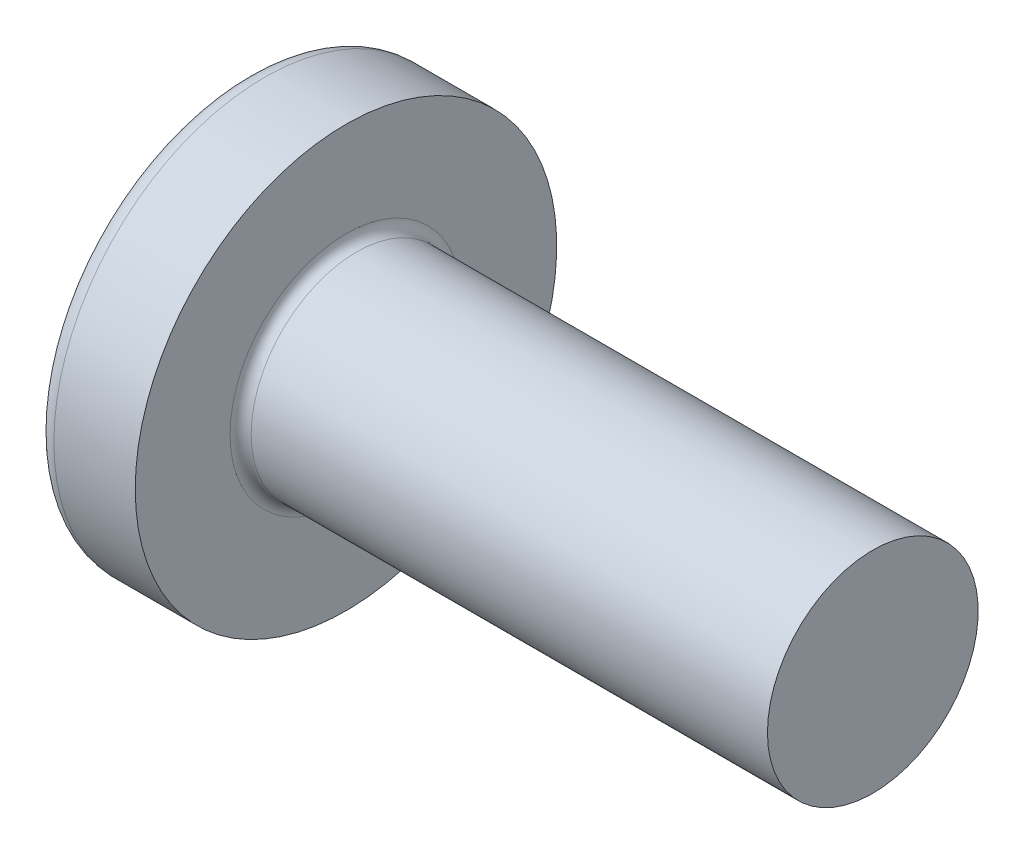
ISO-10303-21;
HEADER;
FILE_DESCRIPTION(('STEP AP214'),'2;1');
FILE_NAME('part.step','',(''),(''),'','','');
FILE_SCHEMA(('AUTOMOTIVE_DESIGN { 1 0 10303 214 1 1 1 1 }'));
ENDSEC;
DATA;
#1=APPLICATION_CONTEXT('core data for automotive mechanical design processes');
#2=APPLICATION_PROTOCOL_DEFINITION('international standard','automotive_design',2000,#1);
#3=PRODUCT_CONTEXT('',#1,'mechanical');
#4=PRODUCT('Part','Part','',(#3));
#5=PRODUCT_RELATED_PRODUCT_CATEGORY('part','',(#4));
#6=PRODUCT_DEFINITION_FORMATION('','',#4);
#7=PRODUCT_DEFINITION_CONTEXT('part definition',#1,'design');
#8=PRODUCT_DEFINITION('design','',#6,#7);
#9=PRODUCT_DEFINITION_SHAPE('','',#8);
#10=(LENGTH_UNIT() NAMED_UNIT(*) SI_UNIT(.MILLI.,.METRE.));
#11=(NAMED_UNIT(*) PLANE_ANGLE_UNIT() SI_UNIT($,.RADIAN.));
#12=(NAMED_UNIT(*) SI_UNIT($,.STERADIAN.) SOLID_ANGLE_UNIT());
#13=UNCERTAINTY_MEASURE_WITH_UNIT(LENGTH_MEASURE(1.E-05),#10,'distance_accuracy_value','');
#14=(GEOMETRIC_REPRESENTATION_CONTEXT(3) GLOBAL_UNCERTAINTY_ASSIGNED_CONTEXT((#13)) GLOBAL_UNIT_ASSIGNED_CONTEXT((#10,
#11,#12)) REPRESENTATION_CONTEXT('',''));
#15=CARTESIAN_POINT('',(0.,0.,0.));
#16=DIRECTION('',(0.,0.,1.));
#17=DIRECTION('',(1.,0.,0.));
#18=AXIS2_PLACEMENT_3D('',#15,#16,#17);
#19=CARTESIAN_POINT('',(6.5,0.,0.));
#20=DIRECTION('',(-1.,0.,0.));
#21=DIRECTION('',(0.,1.,0.));
#22=AXIS2_PLACEMENT_3D('',#19,#20,#21);
#23=SPHERICAL_SURFACE('',#22,6.5);
#24=CARTESIAN_POINT('',(1.26538895452803,0.,0.));
#25=DIRECTION('',(-1.,0.,0.));
#26=DIRECTION('',(0.,0.,1.));
#27=AXIS2_PLACEMENT_3D('',#24,#25,#26);
#28=CIRCLE('',#27,3.85342019543974);
#29=CARTESIAN_POINT('',(1.26538895452803,0.,3.85342019543974));
#30=VERTEX_POINT('',#29);
#31=EDGE_CURVE('E220',#30,#30,#28,.T.);
#32=ORIENTED_EDGE('',*,*,#31,.T.);
#33=EDGE_LOOP('',(#32));
#34=FACE_BOUND('',#33,.T.);
#35=CARTESIAN_POINT('',(0.0788099820016241,0.,0.));
#36=DIRECTION('',(1.,0.,0.));
#37=DIRECTION('',(0.,0.,-1.));
#38=AXIS2_PLACEMENT_3D('',#35,#36,#37);
#39=CIRCLE('',#38,1.0091178091571);
#40=CARTESIAN_POINT('',(0.0788099820016244,-0.514999999999996,-0.867809744562728));
#41=VERTEX_POINT('',#40);
#42=CARTESIAN_POINT('',(0.0788099820016241,-0.867809744562729,-0.515));
#43=VERTEX_POINT('',#42);
#44=EDGE_CURVE('E347',#41,#43,#39,.F.);
#45=ORIENTED_EDGE('',*,*,#44,.F.);
#46=CARTESIAN_POINT('',(6.5,-0.515000000000001,0.));
#47=DIRECTION('',(0.,1.,0.));
#48=DIRECTION('',(0.,0.,1.));
#49=AXIS2_PLACEMENT_3D('',#46,#47,#48);
#50=CIRCLE('',#49,6.47956595768575);
#51=CARTESIAN_POINT('',(0.331830520157854,-0.514999999999992,-1.98455543332603));
#52=VERTEX_POINT('',#51);
#53=EDGE_CURVE('E280',#52,#41,#50,.T.);
#54=ORIENTED_EDGE('',*,*,#53,.F.);
#55=CARTESIAN_POINT('',(6.06443225879603,0.,0.873613881878153));
#56=DIRECTION('',(0.446197753347436,0.,-0.894934391398443));
#57=DIRECTION('',(-0.894934391398442,0.,-0.446197753347436));
#58=AXIS2_PLACEMENT_3D('',#55,#56,#57);
#59=CIRCLE('',#58,6.42628038045433);
#60=CARTESIAN_POINT('',(0.331830520157856,0.515000000000007,-1.98455543332603));
#61=VERTEX_POINT('',#60);
#62=EDGE_CURVE('E254',#52,#61,#59,.T.);
#63=ORIENTED_EDGE('',*,*,#62,.T.);
#64=CARTESIAN_POINT('',(6.5,0.515,0.));
#65=DIRECTION('',(0.,-1.,0.));
#66=DIRECTION('',(0.,0.,-1.));
#67=AXIS2_PLACEMENT_3D('',#64,#65,#66);
#68=CIRCLE('',#67,6.47956595768574);
#69=CARTESIAN_POINT('',(0.0788099820016249,0.515000000000003,-0.867809744562724));
#70=VERTEX_POINT('',#69);
#71=EDGE_CURVE('E309',#70,#61,#68,.T.);
#72=ORIENTED_EDGE('',*,*,#71,.F.);
#73=CARTESIAN_POINT('',(0.0788099820016241,0.867809744562719,-0.515));
#74=VERTEX_POINT('',#73);
#75=EDGE_CURVE('E362',#74,#70,#39,.F.);
#76=ORIENTED_EDGE('',*,*,#75,.F.);
#77=CARTESIAN_POINT('',(6.5,0.,-0.515));
#78=DIRECTION('',(0.,0.,1.));
#79=DIRECTION('',(1.,0.,0.));
#80=AXIS2_PLACEMENT_3D('',#77,#78,#79);
#81=CIRCLE('',#80,6.47956595768574);
#82=CARTESIAN_POINT('',(0.331830520157856,1.98455543332603,-0.515));
#83=VERTEX_POINT('',#82);
#84=EDGE_CURVE('E248',#83,#74,#81,.T.);
#85=ORIENTED_EDGE('',*,*,#84,.F.);
#86=CARTESIAN_POINT('',(6.06443225879604,-0.873613881878154,0.));
#87=DIRECTION('',(0.446197753347436,0.894934391398443,0.));
#88=DIRECTION('',(-0.894934391398442,0.446197753347436,0.));
#89=AXIS2_PLACEMENT_3D('',#86,#87,#88);
#90=CIRCLE('',#89,6.42628038045433);
#91=CARTESIAN_POINT('',(0.331830520157857,1.98455543332603,0.515));
#92=VERTEX_POINT('',#91);
#93=EDGE_CURVE('E251',#83,#92,#90,.T.);
#94=ORIENTED_EDGE('',*,*,#93,.T.);
#95=CARTESIAN_POINT('',(6.5,0.,0.515000000000001));
#96=DIRECTION('',(0.,0.,-1.));
#97=DIRECTION('',(-1.,0.,0.));
#98=AXIS2_PLACEMENT_3D('',#95,#96,#97);
#99=CIRCLE('',#98,6.47956595768574);
#100=CARTESIAN_POINT('',(0.0788099820016241,0.867809744562719,0.514999999999999));
#101=VERTEX_POINT('',#100);
#102=EDGE_CURVE('E244',#101,#92,#99,.T.);
#103=ORIENTED_EDGE('',*,*,#102,.F.);
#104=CARTESIAN_POINT('',(0.0788099820016253,0.514999999999997,0.867809744562727));
#105=VERTEX_POINT('',#104);
#106=EDGE_CURVE('E361',#105,#101,#39,.F.);
#107=ORIENTED_EDGE('',*,*,#106,.F.);
#108=CARTESIAN_POINT('',(0.331830520157856,0.514999999999993,1.98455543332603));
#109=VERTEX_POINT('',#108);
#110=EDGE_CURVE('E264',#109,#105,#68,.T.);
#111=ORIENTED_EDGE('',*,*,#110,.F.);
#112=CARTESIAN_POINT('',(6.06443225879603,0.,-0.873613881878153));
#113=DIRECTION('',(0.446197753347436,0.,0.894934391398443));
#114=DIRECTION('',(0.894934391398442,0.,-0.446197753347436));
#115=AXIS2_PLACEMENT_3D('',#112,#113,#114);
#116=CIRCLE('',#115,6.42628038045433);
#117=CARTESIAN_POINT('',(0.331830520157855,-0.515000000000007,1.98455543332603));
#118=VERTEX_POINT('',#117);
#119=EDGE_CURVE('E53',#109,#118,#116,.T.);
#120=ORIENTED_EDGE('',*,*,#119,.T.);
#121=CARTESIAN_POINT('',(0.0788099820016247,-0.515000000000003,0.867809744562724));
#122=VERTEX_POINT('',#121);
#123=EDGE_CURVE('E261',#122,#118,#50,.T.);
#124=ORIENTED_EDGE('',*,*,#123,.F.);
#125=CARTESIAN_POINT('',(0.0788099820016241,-0.867809744562729,0.514999999999999));
#126=VERTEX_POINT('',#125);
#127=EDGE_CURVE('E397',#126,#122,#39,.F.);
#128=ORIENTED_EDGE('',*,*,#127,.F.);
#129=CARTESIAN_POINT('',(0.331830520157853,-1.98455543332603,0.514999999999999));
#130=VERTEX_POINT('',#129);
#131=EDGE_CURVE('E245',#130,#126,#99,.T.);
#132=ORIENTED_EDGE('',*,*,#131,.F.);
#133=CARTESIAN_POINT('',(6.06443225879603,0.873613881878152,0.));
#134=DIRECTION('',(0.446197753347436,-0.894934391398443,0.));
#135=DIRECTION('',(0.894934391398442,0.446197753347436,0.));
#136=AXIS2_PLACEMENT_3D('',#133,#134,#135);
#137=CIRCLE('',#136,6.42628038045433);
#138=CARTESIAN_POINT('',(0.331830520157853,-1.98455543332603,-0.515));
#139=VERTEX_POINT('',#138);
#140=EDGE_CURVE('E241',#130,#139,#137,.T.);
#141=ORIENTED_EDGE('',*,*,#140,.T.);
#142=EDGE_CURVE('E68',#43,#139,#81,.T.);
#143=ORIENTED_EDGE('',*,*,#142,.F.);
#144=EDGE_LOOP('',(#45,#54,#63,#72,#76,#85,#94,#103,#107,#111,#120,#124,#128,#132,#141,#143));
#145=FACE_BOUND('',#144,.T.);
#146=ADVANCED_FACE('F39',(#34,#145),#23,.T.);
#147=CARTESIAN_POINT('',(0.,2.15,-0.515));
#148=DIRECTION('',(0.,0.,1.));
#149=DIRECTION('',(1.,0.,0.));
#150=AXIS2_PLACEMENT_3D('',#147,#148,#149);
#151=PLANE('',#150);
#152=ORIENTED_EDGE('',*,*,#84,.T.);
#153=CARTESIAN_POINT('',(-1.51195208675156,0.994972220320188,-0.515));
#154=CARTESIAN_POINT('',(-1.20405981949279,0.970722016949958,-0.515));
#155=CARTESIAN_POINT('',(-0.896180907521174,0.946299109919651,-0.515));
#156=CARTESIAN_POINT('',(-0.280449079832185,0.896981122427851,-0.515));
#157=CARTESIAN_POINT('',(0.0274038344396872,0.872086023934883,-0.515));
#158=CARTESIAN_POINT('',(0.489146739515351,0.83429553519528,-0.515));
#159=CARTESIAN_POINT('',(0.643055047553846,0.821624058404092,-0.515));
#160=CARTESIAN_POINT('',(0.950856520197141,0.796108332639504,-0.515));
#161=CARTESIAN_POINT('',(1.10474968487868,0.783264084592466,-0.515));
#162=CARTESIAN_POINT('',(1.41251352095103,0.757376569093378,-0.515));
#163=CARTESIAN_POINT('',(1.56638419296577,0.744333309065218,-0.515));
#164=CARTESIAN_POINT('',(1.87410847343335,0.718013273188896,-0.515));
#165=CARTESIAN_POINT('',(2.02796208151372,0.704736492982792,-0.515));
#166=CARTESIAN_POINT('',(2.36455311890989,0.675386943006726,-0.515));
#167=CARTESIAN_POINT('',(2.54728562293342,0.659257575640986,-0.515));
#168=CARTESIAN_POINT('',(2.91270624109256,0.626517182479888,-0.515));
#169=CARTESIAN_POINT('',(3.09539435554038,0.609906160177238,-0.515));
#170=CARTESIAN_POINT('',(3.46069832191612,0.576073027116421,-0.515));
#171=CARTESIAN_POINT('',(3.64331417870068,0.558850968932727,-0.515));
#172=CARTESIAN_POINT('',(4.00847437496567,0.523604864540037,-0.515));
#173=CARTESIAN_POINT('',(4.19101871216888,0.505580794604253,-0.515));
#174=CARTESIAN_POINT('',(4.55606208157937,0.468429191666488,-0.515));
#175=CARTESIAN_POINT('',(4.73856107358022,0.449301262281853,-0.515));
#176=CARTESIAN_POINT('',(5.10337547353418,0.409473604748924,-0.515));
#177=CARTESIAN_POINT('',(5.28569089526422,0.38877400510607,-0.515));
#178=CARTESIAN_POINT('',(5.55897278495411,0.355828287527264,-0.515));
#179=CARTESIAN_POINT('',(5.65005277419685,0.344527918782738,-0.515));
#180=CARTESIAN_POINT('',(5.83209904103607,0.321075174263031,-0.515));
#181=CARTESIAN_POINT('',(5.92306532397915,0.308922840209686,-0.515));
#182=CARTESIAN_POINT('',(6.10486078872898,0.28342733445193,-0.515));
#183=CARTESIAN_POINT('',(6.19568992299379,0.270083817601714,-0.515));
#184=CARTESIAN_POINT('',(6.33172773785679,0.248701420809951,-0.515));
#185=CARTESIAN_POINT('',(6.37704304473344,0.241345446705304,-0.515));
#186=CARTESIAN_POINT('',(6.4675722520141,0.226018953559338,-0.515));
#187=CARTESIAN_POINT('',(6.51278614568082,0.218048394864476,-0.515));
#188=CARTESIAN_POINT('',(6.55793125759548,0.209691465274945,-0.515));
#189=B_SPLINE_CURVE_WITH_KNOTS('',3,(#153,#154,#155,#156,#157,#158,#159,#160,#161,#162,#163,
#164,#165,#166,#167,#168,#169,#170,#171,#172,#173,#174,#175,#176,#177,#178,#179,#180,#181,#182,
#183,#184,#185,#186,#187,#188),.UNSPECIFIED.,.F.,.F.,(4,2,2,2,2,2,2,2,2,2,2,2,2,2,2,2,2,4),(0.,
0.926537709781721,1.85311087258339,2.31639796016285,2.77968256468771,3.24294992902054,
3.70622594801777,4.25655436065378,4.80687878359543,5.35715597005738,5.90744944680718,
6.45794177197673,7.00838913527399,7.28372117336898,7.5590397375059,7.83443833587748,
7.97216007460854,8.10989070671571),.UNSPECIFIED.);
#190=CARTESIAN_POINT('',(2.34,0.677477674908923,-0.515));
#191=VERTEX_POINT('',#190);
#192=EDGE_CURVE('E384',#74,#191,#189,.T.);
#193=ORIENTED_EDGE('',*,*,#192,.T.);
#194=DIRECTION('',(0.,1.,0.));
#195=VECTOR('',#194,1.);
#196=CARTESIAN_POINT('',(2.34,-0.983319232260742,-0.515));
#197=LINE('',#196,#195);
#198=CARTESIAN_POINT('',(2.34,0.983319232260743,-0.515));
#199=VERTEX_POINT('',#198);
#200=EDGE_CURVE('E330',#191,#199,#197,.T.);
#201=ORIENTED_EDGE('',*,*,#200,.T.);
#202=DIRECTION('',(0.894934391398442,-0.446197753347436,0.));
#203=VECTOR('',#202,1.);
#204=CARTESIAN_POINT('',(0.,2.15,-0.515));
#205=LINE('',#204,#203);
#206=EDGE_CURVE('E221',#83,#199,#205,.T.);
#207=ORIENTED_EDGE('',*,*,#206,.F.);
#208=EDGE_LOOP('',(#152,#193,#201,#207));
#209=FACE_BOUND('',#208,.T.);
#210=ADVANCED_FACE('F174',(#209),#151,.T.);
#211=CARTESIAN_POINT('',(2.34,-0.983319232260742,-0.515));
#212=VERTEX_POINT('',#211);
#213=CARTESIAN_POINT('',(2.34,-0.677477674908923,-0.515));
#214=VERTEX_POINT('',#213);
#215=EDGE_CURVE('E229',#212,#214,#197,.T.);
#216=ORIENTED_EDGE('',*,*,#215,.T.);
#217=CARTESIAN_POINT('',(-1.51195208675156,-0.994972220320188,-0.515));
#218=CARTESIAN_POINT('',(-1.20405981949279,-0.970722016949958,-0.515));
#219=CARTESIAN_POINT('',(-0.896180907521174,-0.946299109919651,-0.515));
#220=CARTESIAN_POINT('',(-0.280449079832185,-0.896981122427851,-0.515));
#221=CARTESIAN_POINT('',(0.027403834439687,-0.872086023934883,-0.515));
#222=CARTESIAN_POINT('',(0.48914673951535,-0.83429553519528,-0.515));
#223=CARTESIAN_POINT('',(0.643055047553845,-0.821624058404092,-0.515));
#224=CARTESIAN_POINT('',(0.95085652019714,-0.796108332639504,-0.515));
#225=CARTESIAN_POINT('',(1.10474968487868,-0.783264084592466,-0.515));
#226=CARTESIAN_POINT('',(1.41251352095103,-0.757376569093378,-0.515));
#227=CARTESIAN_POINT('',(1.56638419296577,-0.744333309065218,-0.515));
#228=CARTESIAN_POINT('',(1.87410847343335,-0.718013273188896,-0.515));
#229=CARTESIAN_POINT('',(2.02796208151372,-0.704736492982792,-0.515));
#230=CARTESIAN_POINT('',(2.36455311890989,-0.675386943006726,-0.515));
#231=CARTESIAN_POINT('',(2.54728562293342,-0.659257575640986,-0.515));
#232=CARTESIAN_POINT('',(2.91270624109256,-0.626517182479888,-0.515));
#233=CARTESIAN_POINT('',(3.09539435554038,-0.609906160177238,-0.515));
#234=CARTESIAN_POINT('',(3.46069832191613,-0.576073027116421,-0.515));
#235=CARTESIAN_POINT('',(3.64331417870068,-0.558850968932727,-0.515));
#236=CARTESIAN_POINT('',(4.00847437496567,-0.523604864540037,-0.515));
#237=CARTESIAN_POINT('',(4.19101871216888,-0.505580794604252,-0.515));
#238=CARTESIAN_POINT('',(4.55606208157937,-0.468429191666487,-0.515));
#239=CARTESIAN_POINT('',(4.73856107358023,-0.449301262281853,-0.515));
#240=CARTESIAN_POINT('',(5.10337547353419,-0.409473604748924,-0.515));
#241=CARTESIAN_POINT('',(5.28569089526422,-0.388774005106069,-0.515));
#242=CARTESIAN_POINT('',(5.55897278495412,-0.355828287527264,-0.515));
#243=CARTESIAN_POINT('',(5.65005277419686,-0.344527918782738,-0.515));
#244=CARTESIAN_POINT('',(5.83209904103608,-0.32107517426303,-0.515));
#245=CARTESIAN_POINT('',(5.92306532397915,-0.308922840209685,-0.515));
#246=CARTESIAN_POINT('',(6.10486078872898,-0.283427334451929,-0.515));
#247=CARTESIAN_POINT('',(6.1956899229938,-0.270083817601713,-0.515));
#248=CARTESIAN_POINT('',(6.33172773785679,-0.24870142080995,-0.515));
#249=CARTESIAN_POINT('',(6.37704304473344,-0.241345446705303,-0.515));
#250=CARTESIAN_POINT('',(6.4675722520141,-0.226018953559337,-0.515));
#251=CARTESIAN_POINT('',(6.51278614568083,-0.218048394864475,-0.515));
#252=CARTESIAN_POINT('',(6.55793125759549,-0.209691465274944,-0.515));
#253=B_SPLINE_CURVE_WITH_KNOTS('',3,(#217,#218,#219,#220,#221,#222,#223,#224,#225,#226,#227,
#228,#229,#230,#231,#232,#233,#234,#235,#236,#237,#238,#239,#240,#241,#242,#243,#244,#245,#246,
#247,#248,#249,#250,#251,#252),.UNSPECIFIED.,.F.,.F.,(4,2,2,2,2,2,2,2,2,2,2,2,2,2,2,2,2,4),(0.,
0.926537709781721,1.85311087258339,2.31639796016285,2.77968256468771,3.24294992902054,
3.70622594801777,4.25655436065378,4.80687878359543,5.35715597005738,5.90744944680718,
6.45794177197673,7.008389135274,7.28372117336899,7.55903973750591,7.83443833587749,
7.97216007460855,8.10989070671571),.UNSPECIFIED.);
#254=EDGE_CURVE('E360',#214,#43,#253,.F.);
#255=ORIENTED_EDGE('',*,*,#254,.T.);
#256=ORIENTED_EDGE('',*,*,#142,.T.);
#257=DIRECTION('',(0.894934391398442,0.446197753347436,0.));
#258=VECTOR('',#257,1.);
#259=CARTESIAN_POINT('',(0.,-2.15,-0.515));
#260=LINE('',#259,#258);
#261=EDGE_CURVE('E312',#139,#212,#260,.T.);
#262=ORIENTED_EDGE('',*,*,#261,.T.);
#263=EDGE_LOOP('',(#216,#255,#256,#262));
#264=FACE_BOUND('',#263,.T.);
#265=ADVANCED_FACE('F181',(#264),#151,.T.);
#266=CARTESIAN_POINT('',(0.,-2.15,0.514999999999999));
#267=DIRECTION('',(0.,0.,-1.));
#268=DIRECTION('',(-1.,0.,0.));
#269=AXIS2_PLACEMENT_3D('',#266,#267,#268);
#270=PLANE('',#269);
#271=DIRECTION('',(0.,-1.,0.));
#272=VECTOR('',#271,1.);
#273=CARTESIAN_POINT('',(2.34,0.983319232260742,0.515));
#274=LINE('',#273,#272);
#275=CARTESIAN_POINT('',(2.34,0.983319232260743,0.515));
#276=VERTEX_POINT('',#275);
#277=CARTESIAN_POINT('',(2.34,0.677477674908923,0.515));
#278=VERTEX_POINT('',#277);
#279=EDGE_CURVE('E320',#276,#278,#274,.T.);
#280=ORIENTED_EDGE('',*,*,#279,.T.);
#281=CARTESIAN_POINT('',(-1.51195208675156,0.994972220320188,0.514999999999999));
#282=CARTESIAN_POINT('',(-1.20405981949279,0.970722016949958,0.514999999999999));
#283=CARTESIAN_POINT('',(-0.896180907521173,0.946299109919651,0.514999999999999));
#284=CARTESIAN_POINT('',(-0.280449079832185,0.896981122427852,0.514999999999999));
#285=CARTESIAN_POINT('',(0.0274038344396875,0.872086023934883,0.514999999999999));
#286=CARTESIAN_POINT('',(0.489146739515351,0.83429553519528,0.515));
#287=CARTESIAN_POINT('',(0.643055047553846,0.821624058404092,0.515));
#288=CARTESIAN_POINT('',(0.950856520197141,0.796108332639504,0.515));
#289=CARTESIAN_POINT('',(1.10474968487868,0.783264084592466,0.515));
#290=CARTESIAN_POINT('',(1.41251352095103,0.757376569093378,0.515));
#291=CARTESIAN_POINT('',(1.56638419296577,0.744333309065218,0.515));
#292=CARTESIAN_POINT('',(1.87410847343335,0.718013273188896,0.515));
#293=CARTESIAN_POINT('',(2.02796208151372,0.704736492982792,0.515));
#294=CARTESIAN_POINT('',(2.36455311890989,0.675386943006726,0.515));
#295=CARTESIAN_POINT('',(2.54728562293342,0.659257575640986,0.515));
#296=CARTESIAN_POINT('',(2.91270624109256,0.626517182479888,0.515));
#297=CARTESIAN_POINT('',(3.09539435554038,0.609906160177238,0.515));
#298=CARTESIAN_POINT('',(3.46069832191613,0.576073027116421,0.515));
#299=CARTESIAN_POINT('',(3.64331417870068,0.558850968932727,0.515));
#300=CARTESIAN_POINT('',(4.00847437496567,0.523604864540037,0.515));
#301=CARTESIAN_POINT('',(4.19101871216888,0.505580794604252,0.515));
#302=CARTESIAN_POINT('',(4.55606208157937,0.468429191666487,0.515));
#303=CARTESIAN_POINT('',(4.73856107358023,0.449301262281853,0.515000000000001));
#304=CARTESIAN_POINT('',(5.10337547353419,0.409473604748923,0.515000000000001));
#305=CARTESIAN_POINT('',(5.28569089526422,0.388774005106068,0.515000000000001));
#306=CARTESIAN_POINT('',(5.55897278495412,0.355828287527263,0.515000000000001));
#307=CARTESIAN_POINT('',(5.65005277419686,0.344527918782737,0.515000000000001));
#308=CARTESIAN_POINT('',(5.83209904103608,0.32107517426303,0.515000000000001));
#309=CARTESIAN_POINT('',(5.92306532397915,0.308922840209685,0.515000000000001));
#310=CARTESIAN_POINT('',(6.10486078872898,0.283427334451929,0.515000000000001));
#311=CARTESIAN_POINT('',(6.1956899229938,0.270083817601713,0.515000000000001));
#312=CARTESIAN_POINT('',(6.33172773785679,0.248701420809949,0.515000000000001));
#313=CARTESIAN_POINT('',(6.37704304473344,0.241345446705302,0.515000000000001));
#314=CARTESIAN_POINT('',(6.4675722520141,0.226018953559336,0.515000000000001));
#315=CARTESIAN_POINT('',(6.51278614568083,0.218048394864474,0.515000000000001));
#316=CARTESIAN_POINT('',(6.55793125759549,0.209691465274942,0.515000000000001));
#317=B_SPLINE_CURVE_WITH_KNOTS('',3,(#281,#282,#283,#284,#285,#286,#287,#288,#289,#290,#291,
#292,#293,#294,#295,#296,#297,#298,#299,#300,#301,#302,#303,#304,#305,#306,#307,#308,#309,#310,
#311,#312,#313,#314,#315,#316),.UNSPECIFIED.,.F.,.F.,(4,2,2,2,2,2,2,2,2,2,2,2,2,2,2,2,2,4),(0.,
0.926537709781721,1.85311087258339,2.31639796016285,2.77968256468771,3.24294992902054,
3.70622594801777,4.25655436065378,4.80687878359543,5.35715597005738,5.90744944680718,
6.45794177197673,7.008389135274,7.28372117336899,7.55903973750591,7.83443833587749,
7.97216007460855,8.10989070671571),.UNSPECIFIED.);
#318=EDGE_CURVE('E285',#278,#101,#317,.F.);
#319=ORIENTED_EDGE('',*,*,#318,.T.);
#320=ORIENTED_EDGE('',*,*,#102,.T.);
#321=DIRECTION('',(0.894934391398442,-0.446197753347436,0.));
#322=VECTOR('',#321,1.);
#323=CARTESIAN_POINT('',(0.,2.15,0.515));
#324=LINE('',#323,#322);
#325=EDGE_CURVE('E226',#92,#276,#324,.T.);
#326=ORIENTED_EDGE('',*,*,#325,.T.);
#327=EDGE_LOOP('',(#280,#319,#320,#326));
#328=FACE_BOUND('',#327,.T.);
#329=ADVANCED_FACE('F380',(#328),#270,.T.);
#330=ORIENTED_EDGE('',*,*,#131,.T.);
#331=CARTESIAN_POINT('',(-1.51195208675156,-0.994972220320188,0.514999999999999));
#332=CARTESIAN_POINT('',(-1.20405981949279,-0.970722016949958,0.514999999999999));
#333=CARTESIAN_POINT('',(-0.896180907521174,-0.946299109919651,0.514999999999999));
#334=CARTESIAN_POINT('',(-0.280449079832185,-0.896981122427852,0.514999999999999));
#335=CARTESIAN_POINT('',(0.0274038344396874,-0.872086023934883,0.514999999999999));
#336=CARTESIAN_POINT('',(0.489146739515351,-0.83429553519528,0.514999999999999));
#337=CARTESIAN_POINT('',(0.643055047553846,-0.821624058404092,0.514999999999999));
#338=CARTESIAN_POINT('',(0.950856520197141,-0.796108332639504,0.514999999999999));
#339=CARTESIAN_POINT('',(1.10474968487868,-0.783264084592466,0.515));
#340=CARTESIAN_POINT('',(1.41251352095103,-0.757376569093379,0.515));
#341=CARTESIAN_POINT('',(1.56638419296577,-0.744333309065218,0.515));
#342=CARTESIAN_POINT('',(1.87410847343335,-0.718013273188896,0.515));
#343=CARTESIAN_POINT('',(2.02796208151372,-0.704736492982792,0.515));
#344=CARTESIAN_POINT('',(2.36455311890989,-0.675386943006726,0.515));
#345=CARTESIAN_POINT('',(2.54728562293342,-0.659257575640986,0.515));
#346=CARTESIAN_POINT('',(2.91270624109256,-0.626517182479888,0.515));
#347=CARTESIAN_POINT('',(3.09539435554038,-0.609906160177238,0.515));
#348=CARTESIAN_POINT('',(3.46069832191613,-0.576073027116421,0.515));
#349=CARTESIAN_POINT('',(3.64331417870068,-0.558850968932727,0.515));
#350=CARTESIAN_POINT('',(4.00847437496567,-0.523604864540037,0.515));
#351=CARTESIAN_POINT('',(4.19101871216888,-0.505580794604253,0.515));
#352=CARTESIAN_POINT('',(4.55606208157937,-0.468429191666487,0.515));
#353=CARTESIAN_POINT('',(4.73856107358022,-0.449301262281853,0.515));
#354=CARTESIAN_POINT('',(5.10337547353418,-0.409473604748924,0.515));
#355=CARTESIAN_POINT('',(5.28569089526422,-0.388774005106069,0.515));
#356=CARTESIAN_POINT('',(5.55897278495412,-0.355828287527263,0.515000000000001));
#357=CARTESIAN_POINT('',(5.65005277419686,-0.344527918782738,0.515000000000001));
#358=CARTESIAN_POINT('',(5.83209904103607,-0.32107517426303,0.515000000000001));
#359=CARTESIAN_POINT('',(5.92306532397915,-0.308922840209685,0.515000000000001));
#360=CARTESIAN_POINT('',(6.10486078872898,-0.283427334451929,0.515000000000001));
#361=CARTESIAN_POINT('',(6.19568992299379,-0.270083817601713,0.515000000000001));
#362=CARTESIAN_POINT('',(6.33172773785679,-0.24870142080995,0.515000000000001));
#363=CARTESIAN_POINT('',(6.37704304473344,-0.241345446705303,0.515000000000001));
#364=CARTESIAN_POINT('',(6.4675722520141,-0.226018953559336,0.515000000000001));
#365=CARTESIAN_POINT('',(6.51278614568083,-0.218048394864474,0.515000000000001));
#366=CARTESIAN_POINT('',(6.55793125759549,-0.209691465274943,0.515000000000001));
#367=B_SPLINE_CURVE_WITH_KNOTS('',3,(#331,#332,#333,#334,#335,#336,#337,#338,#339,#340,#341,
#342,#343,#344,#345,#346,#347,#348,#349,#350,#351,#352,#353,#354,#355,#356,#357,#358,#359,#360,
#361,#362,#363,#364,#365,#366),.UNSPECIFIED.,.F.,.F.,(4,2,2,2,2,2,2,2,2,2,2,2,2,2,2,2,2,4),(0.,
0.926537709781721,1.85311087258339,2.31639796016285,2.77968256468771,3.24294992902055,
3.70622594801777,4.25655436065378,4.80687878359543,5.35715597005738,5.90744944680718,
6.45794177197673,7.008389135274,7.28372117336899,7.55903973750591,7.83443833587748,
7.97216007460854,8.10989070671571),.UNSPECIFIED.);
#368=CARTESIAN_POINT('',(2.34,-0.677477674908923,0.515));
#369=VERTEX_POINT('',#368);
#370=EDGE_CURVE('E398',#126,#369,#367,.T.);
#371=ORIENTED_EDGE('',*,*,#370,.T.);
#372=CARTESIAN_POINT('',(2.34,-0.983319232260743,0.515));
#373=VERTEX_POINT('',#372);
#374=EDGE_CURVE('E322',#369,#373,#274,.T.);
#375=ORIENTED_EDGE('',*,*,#374,.T.);
#376=DIRECTION('',(0.894934391398443,0.446197753347436,0.));
#377=VECTOR('',#376,1.);
#378=CARTESIAN_POINT('',(0.,-2.15,0.514999999999999));
#379=LINE('',#378,#377);
#380=EDGE_CURVE('E314',#130,#373,#379,.T.);
#381=ORIENTED_EDGE('',*,*,#380,.F.);
#382=EDGE_LOOP('',(#330,#371,#375,#381));
#383=FACE_BOUND('',#382,.T.);
#384=ADVANCED_FACE('F425',(#383),#270,.T.);
#385=CARTESIAN_POINT('',(2.34,0.983319232260742,-0.515));
#386=DIRECTION('',(-1.,0.,0.));
#387=DIRECTION('',(0.,0.,1.));
#388=AXIS2_PLACEMENT_3D('',#385,#386,#387);
#389=PLANE('',#388);
#390=ORIENTED_EDGE('',*,*,#374,.F.);
#391=CARTESIAN_POINT('',(2.34,0.,0.));
#392=DIRECTION('',(-1.,0.,0.));
#393=DIRECTION('',(0.,0.,1.));
#394=AXIS2_PLACEMENT_3D('',#391,#392,#393);
#395=CIRCLE('',#394,0.851);
#396=EDGE_CURVE('E355',#214,#369,#395,.T.);
#397=ORIENTED_EDGE('',*,*,#396,.F.);
#398=ORIENTED_EDGE('',*,*,#215,.F.);
#399=DIRECTION('',(0.,0.,1.));
#400=VECTOR('',#399,1.);
#401=CARTESIAN_POINT('',(2.34,-0.983319232260742,-0.515));
#402=LINE('',#401,#400);
#403=EDGE_CURVE('E317',#212,#373,#402,.T.);
#404=ORIENTED_EDGE('',*,*,#403,.T.);
#405=EDGE_LOOP('',(#390,#397,#398,#404));
#406=FACE_BOUND('',#405,.T.);
#407=ADVANCED_FACE('F423',(#406),#389,.T.);
#408=DIRECTION('',(0.,0.,-1.));
#409=VECTOR('',#408,1.);
#410=CARTESIAN_POINT('',(2.34,-0.515000000000004,0.983319232260741));
#411=LINE('',#410,#409);
#412=CARTESIAN_POINT('',(2.34,-0.514999999999997,-0.677477674908925));
#413=VERTEX_POINT('',#412);
#414=CARTESIAN_POINT('',(2.34,-0.514999999999996,-0.983319232260744));
#415=VERTEX_POINT('',#414);
#416=EDGE_CURVE('E303',#413,#415,#411,.T.);
#417=ORIENTED_EDGE('',*,*,#416,.F.);
#418=CARTESIAN_POINT('',(2.34,0.515000000000003,-0.677477674908921));
#419=VERTEX_POINT('',#418);
#420=EDGE_CURVE('E60',#419,#413,#395,.T.);
#421=ORIENTED_EDGE('',*,*,#420,.F.);
#422=DIRECTION('',(0.,0.,1.));
#423=VECTOR('',#422,1.);
#424=CARTESIAN_POINT('',(2.34,0.515000000000004,-0.983319232260741));
#425=LINE('',#424,#423);
#426=CARTESIAN_POINT('',(2.34,0.515000000000004,-0.983319232260741));
#427=VERTEX_POINT('',#426);
#428=EDGE_CURVE('E306',#427,#419,#425,.T.);
#429=ORIENTED_EDGE('',*,*,#428,.F.);
#430=DIRECTION('',(0.,-1.,0.));
#431=VECTOR('',#430,1.);
#432=CARTESIAN_POINT('',(2.34,0.515000000000004,-0.983319232260741));
#433=LINE('',#432,#431);
#434=EDGE_CURVE('E297',#427,#415,#433,.T.);
#435=ORIENTED_EDGE('',*,*,#434,.T.);
#436=EDGE_LOOP('',(#417,#421,#429,#435));
#437=FACE_BOUND('',#436,.T.);
#438=ADVANCED_FACE('F350',(#437),#389,.T.);
#439=ORIENTED_EDGE('',*,*,#200,.F.);
#440=EDGE_CURVE('E354',#278,#191,#395,.T.);
#441=ORIENTED_EDGE('',*,*,#440,.F.);
#442=ORIENTED_EDGE('',*,*,#279,.F.);
#443=DIRECTION('',(0.,0.,-1.));
#444=VECTOR('',#443,1.);
#445=CARTESIAN_POINT('',(2.34,0.983319232260742,0.515));
#446=LINE('',#445,#444);
#447=EDGE_CURVE('E323',#276,#199,#446,.T.);
#448=ORIENTED_EDGE('',*,*,#447,.T.);
#449=EDGE_LOOP('',(#439,#441,#442,#448));
#450=FACE_BOUND('',#449,.T.);
#451=ADVANCED_FACE('F432',(#450),#389,.T.);
#452=CARTESIAN_POINT('',(2.34,0.514999999999998,0.677477674908924));
#453=VERTEX_POINT('',#452);
#454=CARTESIAN_POINT('',(2.34,0.514999999999997,0.983319232260744));
#455=VERTEX_POINT('',#454);
#456=EDGE_CURVE('E278',#453,#455,#425,.T.);
#457=ORIENTED_EDGE('',*,*,#456,.F.);
#458=CARTESIAN_POINT('',(2.34,-0.515000000000003,0.677477674908921));
#459=VERTEX_POINT('',#458);
#460=EDGE_CURVE('E358',#459,#453,#395,.T.);
#461=ORIENTED_EDGE('',*,*,#460,.F.);
#462=CARTESIAN_POINT('',(2.34,-0.515000000000004,0.983319232260741));
#463=VERTEX_POINT('',#462);
#464=EDGE_CURVE('E300',#463,#459,#411,.T.);
#465=ORIENTED_EDGE('',*,*,#464,.F.);
#466=DIRECTION('',(0.,1.,0.));
#467=VECTOR('',#466,1.);
#468=CARTESIAN_POINT('',(2.34,-0.515000000000004,0.983319232260741));
#469=LINE('',#468,#467);
#470=EDGE_CURVE('E304',#463,#455,#469,.T.);
#471=ORIENTED_EDGE('',*,*,#470,.T.);
#472=EDGE_LOOP('',(#457,#461,#465,#471));
#473=FACE_BOUND('',#472,.T.);
#474=ADVANCED_FACE('F427',(#473),#389,.T.);
#475=CARTESIAN_POINT('',(0.,0.514999999999993,2.15));
#476=DIRECTION('',(0.,-1.,0.));
#477=DIRECTION('',(1.,0.,0.));
#478=AXIS2_PLACEMENT_3D('',#475,#476,#477);
#479=PLANE('',#478);
#480=ORIENTED_EDGE('',*,*,#110,.T.);
#481=CARTESIAN_POINT('',(-1.51195208675156,0.514999999999997,0.994972220320189));
#482=CARTESIAN_POINT('',(-1.20405981949279,0.514999999999997,0.97072201694996));
#483=CARTESIAN_POINT('',(-0.896180907521173,0.514999999999997,0.946299109919652));
#484=CARTESIAN_POINT('',(-0.280449079832184,0.514999999999997,0.896981122427853));
#485=CARTESIAN_POINT('',(0.0274038344396879,0.514999999999997,0.872086023934884));
#486=CARTESIAN_POINT('',(0.489146739515351,0.514999999999997,0.834295535195282));
#487=CARTESIAN_POINT('',(0.643055047553846,0.514999999999997,0.821624058404094));
#488=CARTESIAN_POINT('',(0.950856520197141,0.514999999999997,0.796108332639506));
#489=CARTESIAN_POINT('',(1.10474968487868,0.514999999999997,0.783264084592467));
#490=CARTESIAN_POINT('',(1.41251352095103,0.514999999999997,0.75737656909338));
#491=CARTESIAN_POINT('',(1.56638419296577,0.514999999999997,0.74433330906522));
#492=CARTESIAN_POINT('',(1.87410847343335,0.514999999999998,0.718013273188897));
#493=CARTESIAN_POINT('',(2.02796208151372,0.514999999999998,0.704736492982794));
#494=CARTESIAN_POINT('',(2.36455311890989,0.514999999999998,0.675386943006728));
#495=CARTESIAN_POINT('',(2.54728562293342,0.514999999999998,0.659257575640987));
#496=CARTESIAN_POINT('',(2.91270624109256,0.514999999999998,0.626517182479889));
#497=CARTESIAN_POINT('',(3.09539435554038,0.514999999999998,0.60990616017724));
#498=CARTESIAN_POINT('',(3.46069832191613,0.514999999999998,0.576073027116423));
#499=CARTESIAN_POINT('',(3.64331417870068,0.514999999999998,0.558850968932729));
#500=CARTESIAN_POINT('',(4.00847437496567,0.514999999999998,0.523604864540039));
#501=CARTESIAN_POINT('',(4.19101871216888,0.514999999999998,0.505580794604254));
#502=CARTESIAN_POINT('',(4.55606208157937,0.514999999999999,0.468429191666489));
#503=CARTESIAN_POINT('',(4.73856107358023,0.514999999999999,0.449301262281855));
#504=CARTESIAN_POINT('',(5.10337547353419,0.514999999999999,0.409473604748926));
#505=CARTESIAN_POINT('',(5.28569089526422,0.514999999999999,0.388774005106071));
#506=CARTESIAN_POINT('',(5.55897278495412,0.514999999999999,0.355828287527265));
#507=CARTESIAN_POINT('',(5.65005277419686,0.514999999999999,0.344527918782739));
#508=CARTESIAN_POINT('',(5.83209904103608,0.514999999999999,0.321075174263032));
#509=CARTESIAN_POINT('',(5.92306532397915,0.514999999999999,0.308922840209687));
#510=CARTESIAN_POINT('',(6.10486078872898,0.514999999999999,0.283427334451931));
#511=CARTESIAN_POINT('',(6.19568992299379,0.514999999999999,0.270083817601715));
#512=CARTESIAN_POINT('',(6.33172773785679,0.514999999999999,0.248701420809952));
#513=CARTESIAN_POINT('',(6.37704304473344,0.514999999999999,0.241345446705305));
#514=CARTESIAN_POINT('',(6.4675722520141,0.514999999999999,0.226018953559339));
#515=CARTESIAN_POINT('',(6.51278614568083,0.514999999999999,0.218048394864478));
#516=CARTESIAN_POINT('',(6.55793125759549,0.515,0.209691465274946));
#517=B_SPLINE_CURVE_WITH_KNOTS('',3,(#481,#482,#483,#484,#485,#486,#487,#488,#489,#490,#491,
#492,#493,#494,#495,#496,#497,#498,#499,#500,#501,#502,#503,#504,#505,#506,#507,#508,#509,#510,
#511,#512,#513,#514,#515,#516),.UNSPECIFIED.,.F.,.F.,(4,2,2,2,2,2,2,2,2,2,2,2,2,2,2,2,2,4),(0.,
0.926537709781721,1.85311087258339,2.31639796016285,2.77968256468771,3.24294992902054,
3.70622594801777,4.25655436065378,4.80687878359543,5.35715597005738,5.90744944680718,
6.45794177197673,7.008389135274,7.28372117336899,7.55903973750591,7.83443833587748,
7.97216007460854,8.10989070671571),.UNSPECIFIED.);
#518=EDGE_CURVE('E446',#105,#453,#517,.T.);
#519=ORIENTED_EDGE('',*,*,#518,.T.);
#520=ORIENTED_EDGE('',*,*,#456,.T.);
#521=DIRECTION('',(0.894934391398442,0.,-0.446197753347436));
#522=VECTOR('',#521,1.);
#523=CARTESIAN_POINT('',(0.,0.514999999999993,2.15));
#524=LINE('',#523,#522);
#525=EDGE_CURVE('E271',#109,#455,#524,.T.);
#526=ORIENTED_EDGE('',*,*,#525,.F.);
#527=EDGE_LOOP('',(#480,#519,#520,#526));
#528=FACE_BOUND('',#527,.T.);
#529=ADVANCED_FACE('F275',(#528),#479,.T.);
#530=CARTESIAN_POINT('',(0.,-0.514999999999992,-2.15));
#531=DIRECTION('',(0.,1.,0.));
#532=DIRECTION('',(-1.,0.,0.));
#533=AXIS2_PLACEMENT_3D('',#530,#531,#532);
#534=PLANE('',#533);
#535=ORIENTED_EDGE('',*,*,#464,.T.);
#536=CARTESIAN_POINT('',(-1.51195208754037,-0.515000000000003,0.994972220382296));
#537=CARTESIAN_POINT('',(-1.20405982018868,-0.515000000000003,0.970722017005062));
#538=CARTESIAN_POINT('',(-0.896180908124144,-0.515000000000003,0.946299109967687));
#539=CARTESIAN_POINT('',(-0.280449080249313,-0.515000000000003,0.896981122461526));
#540=CARTESIAN_POINT('',(0.027403834115485,-0.515000000000003,0.872086023961263));
#541=CARTESIAN_POINT('',(0.489146739371409,-0.515000000000003,0.834295535207135));
#542=CARTESIAN_POINT('',(0.643055047497245,-0.515000000000003,0.821624058408794));
#543=CARTESIAN_POINT('',(0.950856520315204,-0.515000000000003,0.796108332629704));
#544=CARTESIAN_POINT('',(1.10474968508407,-0.515000000000003,0.783264084575316));
#545=CARTESIAN_POINT('',(1.41251352133103,-0.515000000000003,0.757376569061286));
#546=CARTESIAN_POINT('',(1.56638419343305,-0.515000000000003,0.744333309025532));
#547=CARTESIAN_POINT('',(1.87410847407519,-0.515000000000003,0.718013273133714));
#548=CARTESIAN_POINT('',(2.02796208224283,-0.515000000000002,0.704736492919708));
#549=CARTESIAN_POINT('',(2.36455311972626,-0.515000000000002,0.675386942934954));
#550=CARTESIAN_POINT('',(2.5472856237498,-0.515000000000002,0.659257575568566));
#551=CARTESIAN_POINT('',(2.91270624190895,-0.515000000000002,0.626517182406012));
#552=CARTESIAN_POINT('',(3.09539435635676,-0.515000000000002,0.609906160102553));
#553=CARTESIAN_POINT('',(3.46069832273244,-0.515000000000002,0.576073027039887));
#554=CARTESIAN_POINT('',(3.64331417951694,-0.515000000000002,0.558850968855155));
#555=CARTESIAN_POINT('',(4.00847437578178,-0.515000000000002,0.523604864460042));
#556=CARTESIAN_POINT('',(4.1910187129849,-0.515000000000002,0.505580794522874));
#557=CARTESIAN_POINT('',(4.55606208239526,-0.515000000000002,0.468429191581778));
#558=CARTESIAN_POINT('',(4.73856107439606,-0.515000000000002,0.449301262195196));
#559=CARTESIAN_POINT('',(5.10337547434977,-0.515000000000002,0.409473604657432));
#560=CARTESIAN_POINT('',(5.28569089607961,-0.515000000000002,0.388774005011692));
#561=CARTESIAN_POINT('',(5.55897278576906,-0.515000000000002,0.35582828742708));
#562=CARTESIAN_POINT('',(5.65005277501166,-0.515000000000002,0.344527918680366));
#563=CARTESIAN_POINT('',(5.83209904185046,-0.515000000000002,0.321075174155497));
#564=CARTESIAN_POINT('',(5.92306532479326,-0.515000000000002,0.308922840099178));
#565=CARTESIAN_POINT('',(6.10486078954238,-0.515000000000002,0.28342733433415));
#566=CARTESIAN_POINT('',(6.19568992380676,-0.515000000000002,0.270083817479635));
#567=CARTESIAN_POINT('',(6.33172773866873,-0.515000000000002,0.248701420679476));
#568=CARTESIAN_POINT('',(6.37704304554499,-0.515000000000002,0.241345446571704));
#569=CARTESIAN_POINT('',(6.46757225282465,-0.515000000000002,0.22601895341842));
#570=CARTESIAN_POINT('',(6.51278614649077,-0.515000000000002,0.218048394719365));
#571=CARTESIAN_POINT('',(6.55793125840465,-0.515000000000002,0.209691465124898));
#572=B_SPLINE_CURVE_WITH_KNOTS('',3,(#536,#537,#538,#539,#540,#541,#542,#543,#544,#545,#546,
#547,#548,#549,#550,#551,#552,#553,#554,#555,#556,#557,#558,#559,#560,#561,#562,#563,#564,#565,
#566,#567,#568,#569,#570,#571),.UNSPECIFIED.,.F.,.F.,(4,2,2,2,2,2,2,2,2,2,2,2,2,2,2,2,2,4),(0.,
0.926537710061278,1.85311087314258,2.31639796098494,2.77968256577269,3.24294993036838,
3.70622594962848,4.25655436226469,4.80687878520654,5.3571559716686,5.90744944841854,
6.45794177358856,7.00838913688618,7.28372117498157,7.55903973911884,7.83443833749096,
7.97216007622236,8.10989070832989),.UNSPECIFIED.);
#573=EDGE_CURVE('E390',#459,#122,#572,.F.);
#574=ORIENTED_EDGE('',*,*,#573,.T.);
#575=ORIENTED_EDGE('',*,*,#123,.T.);
#576=DIRECTION('',(0.894934391398442,0.,-0.446197753347436));
#577=VECTOR('',#576,1.);
#578=CARTESIAN_POINT('',(0.,-0.515000000000007,2.15));
#579=LINE('',#578,#577);
#580=EDGE_CURVE('E273',#118,#463,#579,.T.);
#581=ORIENTED_EDGE('',*,*,#580,.T.);
#582=EDGE_LOOP('',(#535,#574,#575,#581));
#583=FACE_BOUND('',#582,.T.);
#584=ADVANCED_FACE('F211',(#583),#534,.T.);
#585=ORIENTED_EDGE('',*,*,#428,.T.);
#586=CARTESIAN_POINT('',(-1.51195208754037,0.515000000000004,-0.994972220382296));
#587=CARTESIAN_POINT('',(-1.20405982018868,0.515000000000003,-0.970722017005062));
#588=CARTESIAN_POINT('',(-0.896180908124144,0.515000000000003,-0.946299109967687));
#589=CARTESIAN_POINT('',(-0.280449080249312,0.515000000000003,-0.896981122461525));
#590=CARTESIAN_POINT('',(0.0274038341154851,0.515000000000003,-0.872086023961263));
#591=CARTESIAN_POINT('',(0.489146739371408,0.515000000000003,-0.834295535207134));
#592=CARTESIAN_POINT('',(0.643055047497245,0.515000000000003,-0.821624058408794));
#593=CARTESIAN_POINT('',(0.950856520315203,0.515000000000003,-0.796108332629704));
#594=CARTESIAN_POINT('',(1.10474968508407,0.515000000000003,-0.783264084575316));
#595=CARTESIAN_POINT('',(1.41251352133103,0.515000000000003,-0.757376569061286));
#596=CARTESIAN_POINT('',(1.56638419343305,0.515000000000003,-0.744333309025532));
#597=CARTESIAN_POINT('',(1.87410847407519,0.515000000000003,-0.718013273133714));
#598=CARTESIAN_POINT('',(2.02796208224283,0.515000000000003,-0.704736492919708));
#599=CARTESIAN_POINT('',(2.36455311972626,0.515000000000002,-0.675386942934954));
#600=CARTESIAN_POINT('',(2.5472856237498,0.515000000000002,-0.659257575568566));
#601=CARTESIAN_POINT('',(2.91270624190895,0.515000000000002,-0.626517182406012));
#602=CARTESIAN_POINT('',(3.09539435635676,0.515000000000002,-0.609906160102552));
#603=CARTESIAN_POINT('',(3.46069832273244,0.515000000000002,-0.576073027039887));
#604=CARTESIAN_POINT('',(3.64331417951694,0.515000000000002,-0.558850968855155));
#605=CARTESIAN_POINT('',(4.00847437578178,0.515000000000002,-0.523604864460042));
#606=CARTESIAN_POINT('',(4.1910187129849,0.515000000000002,-0.505580794522874));
#607=CARTESIAN_POINT('',(4.55606208239526,0.515000000000002,-0.468429191581778));
#608=CARTESIAN_POINT('',(4.73856107439606,0.515000000000002,-0.449301262195196));
#609=CARTESIAN_POINT('',(5.10337547434977,0.515000000000002,-0.409473604657433));
#610=CARTESIAN_POINT('',(5.28569089607961,0.515000000000002,-0.388774005011693));
#611=CARTESIAN_POINT('',(5.55897278576906,0.515000000000002,-0.35582828742708));
#612=CARTESIAN_POINT('',(5.65005277501166,0.515000000000001,-0.344527918680367));
#613=CARTESIAN_POINT('',(5.83209904185046,0.515000000000001,-0.321075174155498));
#614=CARTESIAN_POINT('',(5.92306532479326,0.515000000000001,-0.308922840099179));
#615=CARTESIAN_POINT('',(6.10486078954238,0.515000000000001,-0.283427334334151));
#616=CARTESIAN_POINT('',(6.19568992380675,0.515000000000001,-0.270083817479635));
#617=CARTESIAN_POINT('',(6.33172773866873,0.515000000000001,-0.248701420679477));
#618=CARTESIAN_POINT('',(6.37704304554499,0.515000000000001,-0.241345446571705));
#619=CARTESIAN_POINT('',(6.46757225282465,0.515000000000001,-0.226018953418421));
#620=CARTESIAN_POINT('',(6.51278614649077,0.515000000000001,-0.218048394719367));
#621=CARTESIAN_POINT('',(6.55793125840465,0.515000000000001,-0.209691465124899));
#622=B_SPLINE_CURVE_WITH_KNOTS('',3,(#586,#587,#588,#589,#590,#591,#592,#593,#594,#595,#596,
#597,#598,#599,#600,#601,#602,#603,#604,#605,#606,#607,#608,#609,#610,#611,#612,#613,#614,#615,
#616,#617,#618,#619,#620,#621),.UNSPECIFIED.,.F.,.F.,(4,2,2,2,2,2,2,2,2,2,2,2,2,2,2,2,2,4),(0.,
0.926537710061278,1.85311087314258,2.31639796098494,2.77968256577269,3.24294993036838,
3.70622594962848,4.25655436226469,4.80687878520654,5.3571559716686,5.90744944841855,
6.45794177358856,7.00838913688618,7.28372117498156,7.55903973911884,7.83443833749096,
7.97216007622236,8.10989070832989),.UNSPECIFIED.);
#623=EDGE_CURVE('E339',#419,#70,#622,.F.);
#624=ORIENTED_EDGE('',*,*,#623,.T.);
#625=ORIENTED_EDGE('',*,*,#71,.T.);
#626=DIRECTION('',(0.894934391398442,0.,0.446197753347436));
#627=VECTOR('',#626,1.);
#628=CARTESIAN_POINT('',(0.,0.515000000000008,-2.15));
#629=LINE('',#628,#627);
#630=EDGE_CURVE('E282',#61,#427,#629,.T.);
#631=ORIENTED_EDGE('',*,*,#630,.T.);
#632=EDGE_LOOP('',(#585,#624,#625,#631));
#633=FACE_BOUND('',#632,.T.);
#634=ADVANCED_FACE('F209',(#633),#479,.T.);
#635=ORIENTED_EDGE('',*,*,#53,.T.);
#636=CARTESIAN_POINT('',(-1.51195208675156,-0.514999999999996,-0.99497222032019));
#637=CARTESIAN_POINT('',(-1.20405981949279,-0.514999999999996,-0.97072201694996));
#638=CARTESIAN_POINT('',(-0.896180907521174,-0.514999999999996,-0.946299109919653));
#639=CARTESIAN_POINT('',(-0.280449079832186,-0.514999999999996,-0.896981122427854));
#640=CARTESIAN_POINT('',(0.0274038344396869,-0.514999999999996,-0.872086023934885));
#641=CARTESIAN_POINT('',(0.48914673951535,-0.514999999999997,-0.834295535195282));
#642=CARTESIAN_POINT('',(0.643055047553845,-0.514999999999997,-0.821624058404094));
#643=CARTESIAN_POINT('',(0.95085652019714,-0.514999999999997,-0.796108332639506));
#644=CARTESIAN_POINT('',(1.10474968487868,-0.514999999999997,-0.783264084592468));
#645=CARTESIAN_POINT('',(1.41251352095103,-0.514999999999997,-0.757376569093381));
#646=CARTESIAN_POINT('',(1.56638419296577,-0.514999999999997,-0.74433330906522));
#647=CARTESIAN_POINT('',(1.87410847343335,-0.514999999999997,-0.718013273188898));
#648=CARTESIAN_POINT('',(2.02796208151372,-0.514999999999997,-0.704736492982794));
#649=CARTESIAN_POINT('',(2.36455311890989,-0.514999999999998,-0.675386943006728));
#650=CARTESIAN_POINT('',(2.54728562293342,-0.514999999999998,-0.659257575640988));
#651=CARTESIAN_POINT('',(2.91270624109256,-0.514999999999998,-0.62651718247989));
#652=CARTESIAN_POINT('',(3.09539435554038,-0.514999999999998,-0.60990616017724));
#653=CARTESIAN_POINT('',(3.46069832191612,-0.514999999999998,-0.576073027116423));
#654=CARTESIAN_POINT('',(3.64331417870068,-0.514999999999998,-0.558850968932729));
#655=CARTESIAN_POINT('',(4.00847437496567,-0.514999999999998,-0.523604864540039));
#656=CARTESIAN_POINT('',(4.19101871216888,-0.514999999999999,-0.505580794604254));
#657=CARTESIAN_POINT('',(4.55606208157937,-0.514999999999999,-0.468429191666489));
#658=CARTESIAN_POINT('',(4.73856107358022,-0.514999999999999,-0.449301262281855));
#659=CARTESIAN_POINT('',(5.10337547353418,-0.514999999999999,-0.409473604748926));
#660=CARTESIAN_POINT('',(5.28569089526422,-0.514999999999999,-0.388774005106071));
#661=CARTESIAN_POINT('',(5.55897278495412,-0.514999999999999,-0.355828287527265));
#662=CARTESIAN_POINT('',(5.65005277419686,-0.514999999999999,-0.34452791878274));
#663=CARTESIAN_POINT('',(5.83209904103607,-0.515,-0.321075174263032));
#664=CARTESIAN_POINT('',(5.92306532397915,-0.515,-0.308922840209687));
#665=CARTESIAN_POINT('',(6.10486078872898,-0.515,-0.283427334451931));
#666=CARTESIAN_POINT('',(6.19568992299379,-0.515,-0.270083817601715));
#667=CARTESIAN_POINT('',(6.33172773785679,-0.515,-0.248701420809951));
#668=CARTESIAN_POINT('',(6.37704304473344,-0.515,-0.241345446705304));
#669=CARTESIAN_POINT('',(6.4675722520141,-0.515,-0.226018953559338));
#670=CARTESIAN_POINT('',(6.51278614568083,-0.515,-0.218048394864476));
#671=CARTESIAN_POINT('',(6.55793125759548,-0.515,-0.209691465274945));
#672=B_SPLINE_CURVE_WITH_KNOTS('',3,(#636,#637,#638,#639,#640,#641,#642,#643,#644,#645,#646,
#647,#648,#649,#650,#651,#652,#653,#654,#655,#656,#657,#658,#659,#660,#661,#662,#663,#664,#665,
#666,#667,#668,#669,#670,#671),.UNSPECIFIED.,.F.,.F.,(4,2,2,2,2,2,2,2,2,2,2,2,2,2,2,2,2,4),(0.,
0.926537709781721,1.85311087258339,2.31639796016285,2.77968256468771,3.24294992902054,
3.70622594801777,4.25655436065378,4.80687878359543,5.35715597005738,5.90744944680718,
6.45794177197673,7.008389135274,7.28372117336899,7.55903973750591,7.83443833587749,
7.97216007460855,8.10989070671571),.UNSPECIFIED.);
#673=EDGE_CURVE('E11',#41,#413,#672,.T.);
#674=ORIENTED_EDGE('',*,*,#673,.T.);
#675=ORIENTED_EDGE('',*,*,#416,.T.);
#676=DIRECTION('',(0.894934391398443,0.,0.446197753347436));
#677=VECTOR('',#676,1.);
#678=CARTESIAN_POINT('',(0.,-0.514999999999992,-2.15));
#679=LINE('',#678,#677);
#680=EDGE_CURVE('E294',#52,#415,#679,.T.);
#681=ORIENTED_EDGE('',*,*,#680,.F.);
#682=EDGE_LOOP('',(#635,#674,#675,#681));
#683=FACE_BOUND('',#682,.T.);
#684=ADVANCED_FACE('F203',(#683),#534,.T.);
#685=CARTESIAN_POINT('',(-25.4,0.,0.));
#686=DIRECTION('',(-1.,0.,0.));
#687=DIRECTION('',(0.,0.,1.));
#688=AXIS2_PLACEMENT_3D('',#685,#686,#687);
#689=CYLINDRICAL_SURFACE('',#688,2.);
#690=CARTESIAN_POINT('',(3.3,0.,0.));
#691=DIRECTION('',(-1.,0.,0.));
#692=DIRECTION('',(0.,0.,1.));
#693=AXIS2_PLACEMENT_3D('',#690,#691,#692);
#694=CIRCLE('',#693,2.);
#695=CARTESIAN_POINT('',(3.3,0.,2.));
#696=VERTEX_POINT('',#695);
#697=EDGE_CURVE('E215',#696,#696,#694,.F.);
#698=ORIENTED_EDGE('',*,*,#697,.T.);
#699=EDGE_LOOP('',(#698));
#700=FACE_BOUND('',#699,.T.);
#701=CARTESIAN_POINT('',(13.1,0.,0.));
#702=DIRECTION('',(-1.,0.,0.));
#703=DIRECTION('',(0.,0.,1.));
#704=AXIS2_PLACEMENT_3D('',#701,#702,#703);
#705=CIRCLE('',#704,2.);
#706=CARTESIAN_POINT('',(13.1,0.,2.));
#707=VERTEX_POINT('',#706);
#708=EDGE_CURVE('E218',#707,#707,#705,.T.);
#709=ORIENTED_EDGE('',*,*,#708,.T.);
#710=EDGE_LOOP('',(#709));
#711=FACE_BOUND('',#710,.T.);
#712=ADVANCED_FACE('F200',(#700,#711),#689,.T.);
#713=CARTESIAN_POINT('',(3.1,2.,0.));
#714=DIRECTION('',(-1.,0.,0.));
#715=DIRECTION('',(0.,0.,1.));
#716=AXIS2_PLACEMENT_3D('',#713,#714,#715);
#717=PLANE('',#716);
#718=CARTESIAN_POINT('',(3.1,0.,0.));
#719=DIRECTION('',(-1.,0.,0.));
#720=DIRECTION('',(0.,0.,1.));
#721=AXIS2_PLACEMENT_3D('',#718,#719,#720);
#722=CIRCLE('',#721,2.2);
#723=CARTESIAN_POINT('',(3.1,0.,2.2));
#724=VERTEX_POINT('',#723);
#725=EDGE_CURVE('E237',#724,#724,#722,.T.);
#726=ORIENTED_EDGE('',*,*,#725,.T.);
#727=EDGE_LOOP('',(#726));
#728=FACE_BOUND('',#727,.T.);
#729=CARTESIAN_POINT('',(3.1,0.,0.));
#730=DIRECTION('',(-1.,0.,0.));
#731=DIRECTION('',(0.,0.,1.));
#732=AXIS2_PLACEMENT_3D('',#729,#730,#731);
#733=CIRCLE('',#732,4.);
#734=CARTESIAN_POINT('',(3.1,0.,4.));
#735=VERTEX_POINT('',#734);
#736=EDGE_CURVE('E234',#735,#735,#733,.T.);
#737=ORIENTED_EDGE('',*,*,#736,.F.);
#738=EDGE_LOOP('',(#737));
#739=FACE_BOUND('',#738,.T.);
#740=ADVANCED_FACE('F197',(#728,#739),#717,.F.);
#741=CARTESIAN_POINT('',(-25.4,0.,0.));
#742=DIRECTION('',(-1.,0.,0.));
#743=DIRECTION('',(0.,0.,1.));
#744=AXIS2_PLACEMENT_3D('',#741,#742,#743);
#745=CYLINDRICAL_SURFACE('',#744,4.);
#746=ORIENTED_EDGE('',*,*,#736,.T.);
#747=EDGE_LOOP('',(#746));
#748=FACE_BOUND('',#747,.T.);
#749=CARTESIAN_POINT('',(1.55530587396956,0.,0.));
#750=DIRECTION('',(-1.,0.,0.));
#751=DIRECTION('',(0.,0.,1.));
#752=AXIS2_PLACEMENT_3D('',#749,#750,#751);
#753=CIRCLE('',#752,4.);
#754=CARTESIAN_POINT('',(1.55530587396956,0.,4.));
#755=VERTEX_POINT('',#754);
#756=EDGE_CURVE('E223',#755,#755,#753,.T.);
#757=ORIENTED_EDGE('',*,*,#756,.F.);
#758=EDGE_LOOP('',(#757));
#759=FACE_BOUND('',#758,.T.);
#760=ADVANCED_FACE('F193',(#748,#759),#745,.T.);
#761=CARTESIAN_POINT('',(1.55530587396956,0.,0.));
#762=DIRECTION('',(-1.,0.,0.));
#763=DIRECTION('',(0.,0.,1.));
#764=AXIS2_PLACEMENT_3D('',#761,#762,#763);
#765=TOROIDAL_SURFACE('',#764,3.64,0.36);
#766=ORIENTED_EDGE('',*,*,#756,.T.);
#767=EDGE_LOOP('',(#766));
#768=FACE_BOUND('',#767,.T.);
#769=ORIENTED_EDGE('',*,*,#31,.F.);
#770=EDGE_LOOP('',(#769));
#771=FACE_BOUND('',#770,.T.);
#772=ADVANCED_FACE('F190',(#768,#771),#765,.T.);
#773=CARTESIAN_POINT('',(13.1,2.,0.));
#774=DIRECTION('',(1.,0.,0.));
#775=DIRECTION('',(0.,0.,-1.));
#776=AXIS2_PLACEMENT_3D('',#773,#774,#775);
#777=PLANE('',#776);
#778=ORIENTED_EDGE('',*,*,#708,.F.);
#779=EDGE_LOOP('',(#778));
#780=FACE_BOUND('',#779,.T.);
#781=ADVANCED_FACE('F188',(#780),#777,.T.);
#782=CARTESIAN_POINT('',(3.3,0.,0.));
#783=DIRECTION('',(-1.,0.,0.));
#784=DIRECTION('',(0.,0.,1.));
#785=AXIS2_PLACEMENT_3D('',#782,#783,#784);
#786=TOROIDAL_SURFACE('',#785,2.2,0.2);
#787=ORIENTED_EDGE('',*,*,#697,.F.);
#788=EDGE_LOOP('',(#787));
#789=FACE_BOUND('',#788,.T.);
#790=ORIENTED_EDGE('',*,*,#725,.F.);
#791=EDGE_LOOP('',(#790));
#792=FACE_BOUND('',#791,.T.);
#793=ADVANCED_FACE('F41',(#789,#792),#786,.F.);
#794=CARTESIAN_POINT('',(2.34,0.983319232260742,0.515));
#795=DIRECTION('',(0.446197753347436,0.894934391398443,0.));
#796=DIRECTION('',(-0.894934391398442,0.446197753347436,0.));
#797=AXIS2_PLACEMENT_3D('',#794,#795,#796);
#798=PLANE('',#797);
#799=ORIENTED_EDGE('',*,*,#206,.T.);
#800=ORIENTED_EDGE('',*,*,#447,.F.);
#801=ORIENTED_EDGE('',*,*,#325,.F.);
#802=ORIENTED_EDGE('',*,*,#93,.F.);
#803=EDGE_LOOP('',(#799,#800,#801,#802));
#804=FACE_BOUND('',#803,.T.);
#805=ADVANCED_FACE('F378',(#804),#798,.F.);
#806=CARTESIAN_POINT('',(0.,-2.15,-0.515));
#807=DIRECTION('',(0.446197753347436,-0.894934391398443,0.));
#808=DIRECTION('',(0.894934391398442,0.446197753347436,0.));
#809=AXIS2_PLACEMENT_3D('',#806,#807,#808);
#810=PLANE('',#809);
#811=ORIENTED_EDGE('',*,*,#380,.T.);
#812=ORIENTED_EDGE('',*,*,#403,.F.);
#813=ORIENTED_EDGE('',*,*,#261,.F.);
#814=ORIENTED_EDGE('',*,*,#140,.F.);
#815=EDGE_LOOP('',(#811,#812,#813,#814));
#816=FACE_BOUND('',#815,.T.);
#817=ADVANCED_FACE('F414',(#816),#810,.F.);
#818=CARTESIAN_POINT('',(2.34,-0.515000000000004,0.983319232260741));
#819=DIRECTION('',(0.446197753347436,0.,0.894934391398443));
#820=DIRECTION('',(-0.894934391398442,0.,0.446197753347436));
#821=AXIS2_PLACEMENT_3D('',#818,#819,#820);
#822=PLANE('',#821);
#823=ORIENTED_EDGE('',*,*,#525,.T.);
#824=ORIENTED_EDGE('',*,*,#470,.F.);
#825=ORIENTED_EDGE('',*,*,#580,.F.);
#826=ORIENTED_EDGE('',*,*,#119,.F.);
#827=EDGE_LOOP('',(#823,#824,#825,#826));
#828=FACE_BOUND('',#827,.T.);
#829=ADVANCED_FACE('F269',(#828),#822,.F.);
#830=CARTESIAN_POINT('',(0.,0.515000000000008,-2.15));
#831=DIRECTION('',(0.446197753347436,0.,-0.894934391398443));
#832=DIRECTION('',(0.894934391398442,0.,0.446197753347436));
#833=AXIS2_PLACEMENT_3D('',#830,#831,#832);
#834=PLANE('',#833);
#835=ORIENTED_EDGE('',*,*,#680,.T.);
#836=ORIENTED_EDGE('',*,*,#434,.F.);
#837=ORIENTED_EDGE('',*,*,#630,.F.);
#838=ORIENTED_EDGE('',*,*,#62,.F.);
#839=EDGE_LOOP('',(#835,#836,#837,#838));
#840=FACE_BOUND('',#839,.T.);
#841=ADVANCED_FACE('F342',(#840),#834,.F.);
#842=CARTESIAN_POINT('',(2.34,0.,0.));
#843=DIRECTION('',(-1.,0.,0.));
#844=DIRECTION('',(0.,0.,1.));
#845=AXIS2_PLACEMENT_3D('',#842,#843,#844);
#846=CONICAL_SURFACE('',#845,0.851,0.0698131700797659);
#847=EDGE_CURVE('E356',#453,#278,#395,.T.);
#848=ORIENTED_EDGE('',*,*,#847,.F.);
#849=ORIENTED_EDGE('',*,*,#518,.F.);
#850=ORIENTED_EDGE('',*,*,#106,.T.);
#851=ORIENTED_EDGE('',*,*,#318,.F.);
#852=EDGE_LOOP('',(#848,#849,#850,#851));
#853=FACE_BOUND('',#852,.T.);
#854=ADVANCED_FACE('F171',(#853),#846,.F.);
#855=ORIENTED_EDGE('',*,*,#127,.T.);
#856=ORIENTED_EDGE('',*,*,#573,.F.);
#857=EDGE_CURVE('E457',#369,#459,#395,.T.);
#858=ORIENTED_EDGE('',*,*,#857,.F.);
#859=ORIENTED_EDGE('',*,*,#370,.F.);
#860=EDGE_LOOP('',(#855,#856,#858,#859));
#861=FACE_BOUND('',#860,.T.);
#862=ADVANCED_FACE('F412',(#861),#846,.F.);
#863=ORIENTED_EDGE('',*,*,#75,.T.);
#864=ORIENTED_EDGE('',*,*,#623,.F.);
#865=EDGE_CURVE('E351',#191,#419,#395,.T.);
#866=ORIENTED_EDGE('',*,*,#865,.F.);
#867=ORIENTED_EDGE('',*,*,#192,.F.);
#868=EDGE_LOOP('',(#863,#864,#866,#867));
#869=FACE_BOUND('',#868,.T.);
#870=ADVANCED_FACE('F169',(#869),#846,.F.);
#871=EDGE_CURVE('E352',#413,#214,#395,.T.);
#872=ORIENTED_EDGE('',*,*,#871,.F.);
#873=ORIENTED_EDGE('',*,*,#673,.F.);
#874=ORIENTED_EDGE('',*,*,#44,.T.);
#875=ORIENTED_EDGE('',*,*,#254,.F.);
#876=EDGE_LOOP('',(#872,#873,#874,#875));
#877=FACE_BOUND('',#876,.T.);
#878=ADVANCED_FACE('F164',(#877),#846,.F.);
#879=CARTESIAN_POINT('',(2.6165066614942,0.,0.));
#880=DIRECTION('',(-1.,0.,0.));
#881=DIRECTION('',(0.,0.,1.));
#882=AXIS2_PLACEMENT_3D('',#879,#880,#881);
#883=CONICAL_SURFACE('',#882,0.,1.25663706143592);
#884=ORIENTED_EDGE('',*,*,#847,.T.);
#885=ORIENTED_EDGE('',*,*,#440,.T.);
#886=ORIENTED_EDGE('',*,*,#865,.T.);
#887=ORIENTED_EDGE('',*,*,#420,.T.);
#888=ORIENTED_EDGE('',*,*,#871,.T.);
#889=ORIENTED_EDGE('',*,*,#396,.T.);
#890=ORIENTED_EDGE('',*,*,#857,.T.);
#891=ORIENTED_EDGE('',*,*,#460,.T.);
#892=EDGE_LOOP('',(#884,#885,#886,#887,#888,#889,#890,#891));
#893=FACE_BOUND('',#892,.T.);
#894=CARTESIAN_POINT('',(2.6165066614942,0.,0.));
#895=VERTEX_POINT('',#894);
#896=VERTEX_LOOP('',#895);
#897=FACE_BOUND('',#896,.T.);
#898=ADVANCED_FACE('F162',(#893,#897),#883,.F.);
#899=CLOSED_SHELL('',(#146,#210,#265,#329,#384,#407,#438,#451,#474,#529,#584,#634,#684,#712,
#740,#760,#772,#781,#793,#805,#817,#829,#841,#854,#862,#870,#878,#898));
#900=MANIFOLD_SOLID_BREP('B2',#899);
#901=ADVANCED_BREP_SHAPE_REPRESENTATION('',(#18,#900),#14);
#902=SHAPE_DEFINITION_REPRESENTATION(#9,#901);
ENDSEC;
END-ISO-10303-21;
